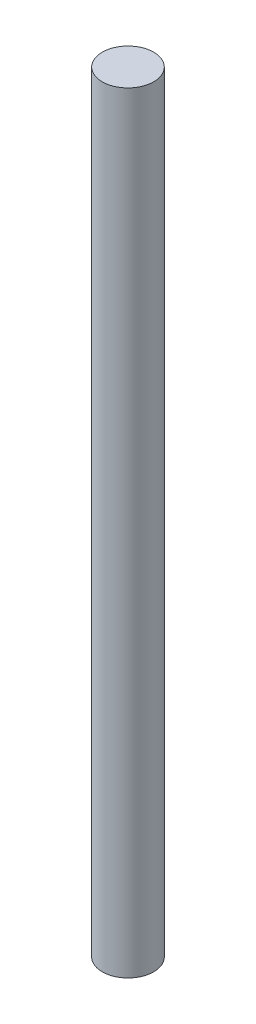
ISO-10303-21;
HEADER;
FILE_DESCRIPTION(('STEP AP214'),'2;1');
FILE_NAME('part.step','',(''),(''),'','','');
FILE_SCHEMA(('AUTOMOTIVE_DESIGN { 1 0 10303 214 1 1 1 1 }'));
ENDSEC;
DATA;
#1=APPLICATION_CONTEXT('core data for automotive mechanical design processes');
#2=APPLICATION_PROTOCOL_DEFINITION('international standard','automotive_design',2000,#1);
#3=PRODUCT_CONTEXT('',#1,'mechanical');
#4=PRODUCT('Part','Part','',(#3));
#5=PRODUCT_RELATED_PRODUCT_CATEGORY('part','',(#4));
#6=PRODUCT_DEFINITION_FORMATION('','',#4);
#7=PRODUCT_DEFINITION_CONTEXT('part definition',#1,'design');
#8=PRODUCT_DEFINITION('design','',#6,#7);
#9=PRODUCT_DEFINITION_SHAPE('','',#8);
#10=(LENGTH_UNIT() NAMED_UNIT(*) SI_UNIT(.MILLI.,.METRE.));
#11=(NAMED_UNIT(*) PLANE_ANGLE_UNIT() SI_UNIT($,.RADIAN.));
#12=(NAMED_UNIT(*) SI_UNIT($,.STERADIAN.) SOLID_ANGLE_UNIT());
#13=UNCERTAINTY_MEASURE_WITH_UNIT(LENGTH_MEASURE(1.E-05),#10,'distance_accuracy_value','');
#14=(GEOMETRIC_REPRESENTATION_CONTEXT(3) GLOBAL_UNCERTAINTY_ASSIGNED_CONTEXT((#13)) GLOBAL_UNIT_ASSIGNED_CONTEXT((#10,
#11,#12)) REPRESENTATION_CONTEXT('',''));
#15=CARTESIAN_POINT('',(0.,0.,0.));
#16=DIRECTION('',(0.,0.,1.));
#17=DIRECTION('',(1.,0.,0.));
#18=AXIS2_PLACEMENT_3D('',#15,#16,#17);
#19=CARTESIAN_POINT('',(0.,114.3,0.));
#20=DIRECTION('',(0.,-1.,0.));
#21=DIRECTION('',(0.,0.,-1.));
#22=AXIS2_PLACEMENT_3D('',#19,#20,#21);
#23=CYLINDRICAL_SURFACE('',#22,3.81);
#24=CARTESIAN_POINT('',(0.,114.3,0.));
#25=DIRECTION('',(0.,1.,0.));
#26=DIRECTION('',(0.,0.,1.));
#27=AXIS2_PLACEMENT_3D('',#24,#25,#26);
#28=CIRCLE('',#27,3.81);
#29=CARTESIAN_POINT('',(0.,114.3,3.81));
#30=VERTEX_POINT('',#29);
#31=EDGE_CURVE('E10',#30,#30,#28,.T.);
#32=ORIENTED_EDGE('',*,*,#31,.F.);
#33=EDGE_LOOP('',(#32));
#34=FACE_BOUND('',#33,.T.);
#35=CARTESIAN_POINT('',(0.,0.,0.));
#36=DIRECTION('',(0.,1.,0.));
#37=DIRECTION('',(0.,0.,1.));
#38=AXIS2_PLACEMENT_3D('',#35,#36,#37);
#39=CIRCLE('',#38,3.81);
#40=CARTESIAN_POINT('',(0.,0.,3.81));
#41=VERTEX_POINT('',#40);
#42=EDGE_CURVE('E34',#41,#41,#39,.T.);
#43=ORIENTED_EDGE('',*,*,#42,.T.);
#44=EDGE_LOOP('',(#43));
#45=FACE_BOUND('',#44,.T.);
#46=ADVANCED_FACE('F31',(#34,#45),#23,.T.);
#47=CARTESIAN_POINT('',(0.,114.3,0.));
#48=DIRECTION('',(0.,1.,0.));
#49=DIRECTION('',(0.,0.,1.));
#50=AXIS2_PLACEMENT_3D('',#47,#48,#49);
#51=PLANE('',#50);
#52=ORIENTED_EDGE('',*,*,#31,.T.);
#53=EDGE_LOOP('',(#52));
#54=FACE_BOUND('',#53,.T.);
#55=ADVANCED_FACE('F46',(#54),#51,.T.);
#56=CARTESIAN_POINT('',(0.,0.,0.));
#57=DIRECTION('',(0.,1.,0.));
#58=DIRECTION('',(0.,0.,1.));
#59=AXIS2_PLACEMENT_3D('',#56,#57,#58);
#60=PLANE('',#59);
#61=ORIENTED_EDGE('',*,*,#42,.F.);
#62=EDGE_LOOP('',(#61));
#63=FACE_BOUND('',#62,.T.);
#64=ADVANCED_FACE('F44',(#63),#60,.F.);
#65=CLOSED_SHELL('',(#46,#55,#64));
#66=MANIFOLD_SOLID_BREP('B2',#65);
#67=ADVANCED_BREP_SHAPE_REPRESENTATION('',(#18,#66),#14);
#68=SHAPE_DEFINITION_REPRESENTATION(#9,#67);
ENDSEC;
END-ISO-10303-21;
